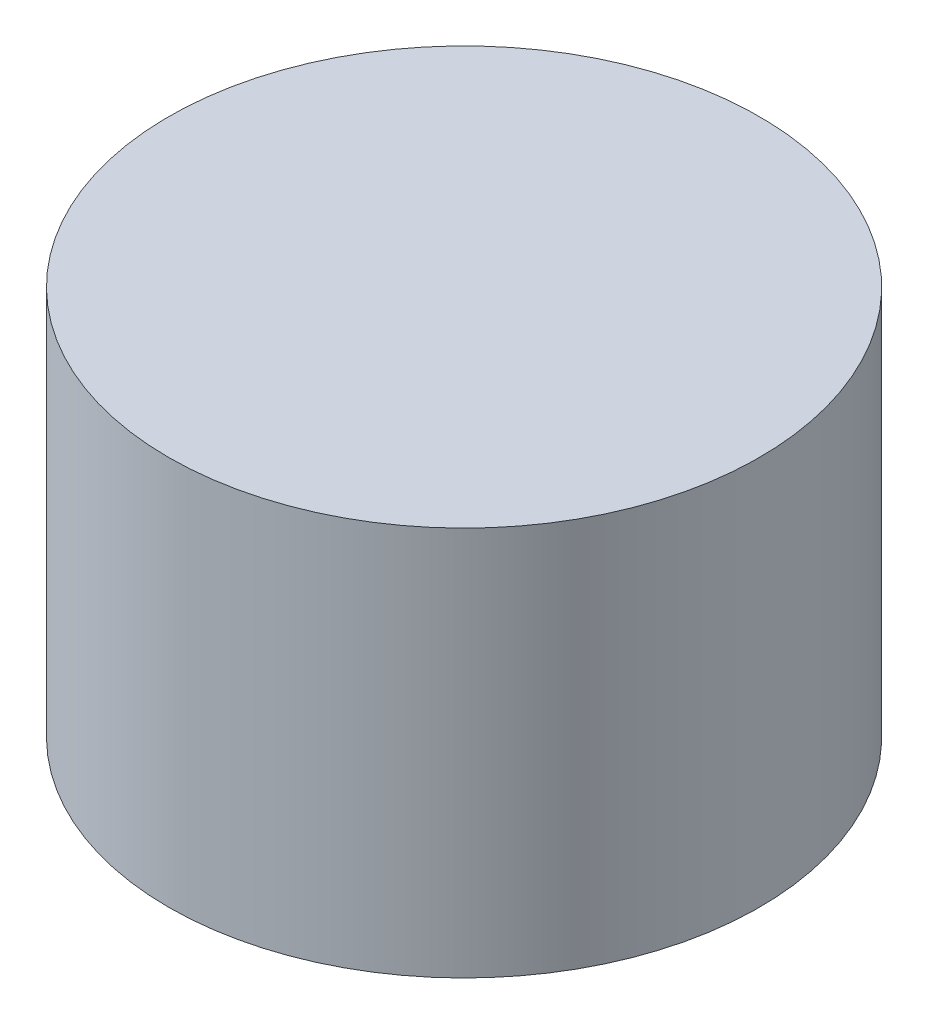
ISO-10303-21;
HEADER;
FILE_DESCRIPTION(('STEP AP214'),'2;1');
FILE_NAME('part.step','',(''),(''),'','','');
FILE_SCHEMA(('AUTOMOTIVE_DESIGN { 1 0 10303 214 1 1 1 1 }'));
ENDSEC;
DATA;
#1=APPLICATION_CONTEXT('core data for automotive mechanical design processes');
#2=APPLICATION_PROTOCOL_DEFINITION('international standard','automotive_design',2000,#1);
#3=PRODUCT_CONTEXT('',#1,'mechanical');
#4=PRODUCT('Part','Part','',(#3));
#5=PRODUCT_RELATED_PRODUCT_CATEGORY('part','',(#4));
#6=PRODUCT_DEFINITION_FORMATION('','',#4);
#7=PRODUCT_DEFINITION_CONTEXT('part definition',#1,'design');
#8=PRODUCT_DEFINITION('design','',#6,#7);
#9=PRODUCT_DEFINITION_SHAPE('','',#8);
#10=(LENGTH_UNIT() NAMED_UNIT(*) SI_UNIT(.MILLI.,.METRE.));
#11=(NAMED_UNIT(*) PLANE_ANGLE_UNIT() SI_UNIT($,.RADIAN.));
#12=(NAMED_UNIT(*) SI_UNIT($,.STERADIAN.) SOLID_ANGLE_UNIT());
#13=UNCERTAINTY_MEASURE_WITH_UNIT(LENGTH_MEASURE(1.E-05),#10,'distance_accuracy_value','');
#14=(GEOMETRIC_REPRESENTATION_CONTEXT(3) GLOBAL_UNCERTAINTY_ASSIGNED_CONTEXT((#13)) GLOBAL_UNIT_ASSIGNED_CONTEXT((#10,
#11,#12)) REPRESENTATION_CONTEXT('',''));
#15=CARTESIAN_POINT('',(0.,0.,0.));
#16=DIRECTION('',(0.,0.,1.));
#17=DIRECTION('',(1.,0.,0.));
#18=AXIS2_PLACEMENT_3D('',#15,#16,#17);
#19=CARTESIAN_POINT('',(0.,6.35,0.));
#20=DIRECTION('',(0.,-1.,0.));
#21=DIRECTION('',(0.,0.,-1.));
#22=AXIS2_PLACEMENT_3D('',#19,#20,#21);
#23=CYLINDRICAL_SURFACE('',#22,4.812919);
#24=CARTESIAN_POINT('',(0.,6.35,0.));
#25=DIRECTION('',(0.,1.,0.));
#26=DIRECTION('',(0.,0.,1.));
#27=AXIS2_PLACEMENT_3D('',#24,#25,#26);
#28=CIRCLE('',#27,4.812919);
#29=CARTESIAN_POINT('',(0.,6.35,4.812919));
#30=VERTEX_POINT('',#29);
#31=EDGE_CURVE('E10',#30,#30,#28,.T.);
#32=ORIENTED_EDGE('',*,*,#31,.F.);
#33=EDGE_LOOP('',(#32));
#34=FACE_BOUND('',#33,.T.);
#35=CARTESIAN_POINT('',(0.,0.,0.));
#36=DIRECTION('',(0.,1.,0.));
#37=DIRECTION('',(0.,0.,1.));
#38=AXIS2_PLACEMENT_3D('',#35,#36,#37);
#39=CIRCLE('',#38,4.812919);
#40=CARTESIAN_POINT('',(0.,0.,4.812919));
#41=VERTEX_POINT('',#40);
#42=EDGE_CURVE('E38',#41,#41,#39,.T.);
#43=ORIENTED_EDGE('',*,*,#42,.T.);
#44=EDGE_LOOP('',(#43));
#45=FACE_BOUND('',#44,.T.);
#46=ADVANCED_FACE('F35',(#34,#45),#23,.T.);
#47=CARTESIAN_POINT('',(0.,6.35,0.));
#48=DIRECTION('',(0.,1.,0.));
#49=DIRECTION('',(0.,0.,1.));
#50=AXIS2_PLACEMENT_3D('',#47,#48,#49);
#51=PLANE('',#50);
#52=ORIENTED_EDGE('',*,*,#31,.T.);
#53=EDGE_LOOP('',(#52));
#54=FACE_BOUND('',#53,.T.);
#55=ADVANCED_FACE('F50',(#54),#51,.T.);
#56=CARTESIAN_POINT('',(0.,0.,0.));
#57=DIRECTION('',(0.,1.,0.));
#58=DIRECTION('',(0.,0.,1.));
#59=AXIS2_PLACEMENT_3D('',#56,#57,#58);
#60=PLANE('',#59);
#61=ORIENTED_EDGE('',*,*,#42,.F.);
#62=EDGE_LOOP('',(#61));
#63=FACE_BOUND('',#62,.T.);
#64=ADVANCED_FACE('F48',(#63),#60,.F.);
#65=CLOSED_SHELL('',(#46,#55,#64));
#66=MANIFOLD_SOLID_BREP('B2',#65);
#67=ADVANCED_BREP_SHAPE_REPRESENTATION('',(#18,#66),#14);
#68=SHAPE_DEFINITION_REPRESENTATION(#9,#67);
ENDSEC;
END-ISO-10303-21;
